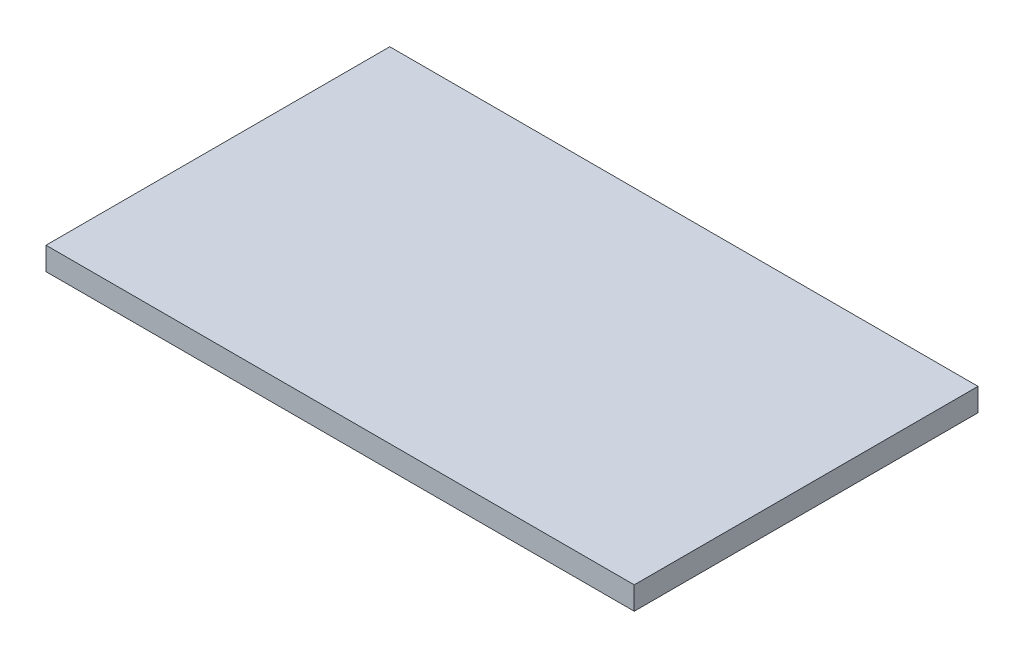
ISO-10303-21;
HEADER;
FILE_DESCRIPTION(('STEP AP214'),'2;1');
FILE_NAME('part.step','',(''),(''),'','','');
FILE_SCHEMA(('AUTOMOTIVE_DESIGN { 1 0 10303 214 1 1 1 1 }'));
ENDSEC;
DATA;
#1=APPLICATION_CONTEXT('core data for automotive mechanical design processes');
#2=APPLICATION_PROTOCOL_DEFINITION('international standard','automotive_design',2000,#1);
#3=PRODUCT_CONTEXT('',#1,'mechanical');
#4=PRODUCT('Part','Part','',(#3));
#5=PRODUCT_RELATED_PRODUCT_CATEGORY('part','',(#4));
#6=PRODUCT_DEFINITION_FORMATION('','',#4);
#7=PRODUCT_DEFINITION_CONTEXT('part definition',#1,'design');
#8=PRODUCT_DEFINITION('design','',#6,#7);
#9=PRODUCT_DEFINITION_SHAPE('','',#8);
#10=(LENGTH_UNIT() NAMED_UNIT(*) SI_UNIT(.MILLI.,.METRE.));
#11=(NAMED_UNIT(*) PLANE_ANGLE_UNIT() SI_UNIT($,.RADIAN.));
#12=(NAMED_UNIT(*) SI_UNIT($,.STERADIAN.) SOLID_ANGLE_UNIT());
#13=UNCERTAINTY_MEASURE_WITH_UNIT(LENGTH_MEASURE(1.E-05),#10,'distance_accuracy_value','');
#14=(GEOMETRIC_REPRESENTATION_CONTEXT(3) GLOBAL_UNCERTAINTY_ASSIGNED_CONTEXT((#13)) GLOBAL_UNIT_ASSIGNED_CONTEXT((#10,
#11,#12)) REPRESENTATION_CONTEXT('',''));
#15=CARTESIAN_POINT('',(0.,0.,0.));
#16=DIRECTION('',(0.,0.,1.));
#17=DIRECTION('',(1.,0.,0.));
#18=AXIS2_PLACEMENT_3D('',#15,#16,#17);
#19=CARTESIAN_POINT('',(-36.5928143712575,3.,-17.5703592814371));
#20=DIRECTION('',(1.,0.,0.));
#21=DIRECTION('',(0.,0.,-1.));
#22=AXIS2_PLACEMENT_3D('',#19,#20,#21);
#23=PLANE('',#22);
#24=DIRECTION('',(0.,0.,1.));
#25=VECTOR('',#24,1.);
#26=CARTESIAN_POINT('',(-36.5928143712575,0.,-17.5703592814371));
#27=LINE('',#26,#25);
#28=CARTESIAN_POINT('',(-36.5928143712575,0.,-17.5703592814371));
#29=VERTEX_POINT('',#28);
#30=CARTESIAN_POINT('',(-36.5928143712575,0.,27.4296407185629));
#31=VERTEX_POINT('',#30);
#32=EDGE_CURVE('E98',#29,#31,#27,.T.);
#33=ORIENTED_EDGE('',*,*,#32,.T.);
#34=DIRECTION('',(0.,-1.,0.));
#35=VECTOR('',#34,1.);
#36=CARTESIAN_POINT('',(-36.5928143712575,3.,27.4296407185629));
#37=LINE('',#36,#35);
#38=CARTESIAN_POINT('',(-36.5928143712575,3.,27.4296407185629));
#39=VERTEX_POINT('',#38);
#40=EDGE_CURVE('E11',#39,#31,#37,.T.);
#41=ORIENTED_EDGE('',*,*,#40,.F.);
#42=DIRECTION('',(0.,0.,1.));
#43=VECTOR('',#42,1.);
#44=CARTESIAN_POINT('',(-36.5928143712575,3.,-17.5703592814371));
#45=LINE('',#44,#43);
#46=CARTESIAN_POINT('',(-36.5928143712575,3.,-17.5703592814371));
#47=VERTEX_POINT('',#46);
#48=EDGE_CURVE('E86',#47,#39,#45,.T.);
#49=ORIENTED_EDGE('',*,*,#48,.F.);
#50=DIRECTION('',(0.,-1.,0.));
#51=VECTOR('',#50,1.);
#52=CARTESIAN_POINT('',(-36.5928143712575,3.,-17.5703592814371));
#53=LINE('',#52,#51);
#54=EDGE_CURVE('E94',#47,#29,#53,.T.);
#55=ORIENTED_EDGE('',*,*,#54,.T.);
#56=EDGE_LOOP('',(#33,#41,#49,#55));
#57=FACE_BOUND('',#56,.T.);
#58=ADVANCED_FACE('F35',(#57),#23,.F.);
#59=CARTESIAN_POINT('',(-36.5928143712575,3.,27.4296407185629));
#60=DIRECTION('',(0.,0.,-1.));
#61=DIRECTION('',(-1.,0.,0.));
#62=AXIS2_PLACEMENT_3D('',#59,#60,#61);
#63=PLANE('',#62);
#64=DIRECTION('',(1.,0.,0.));
#65=VECTOR('',#64,1.);
#66=CARTESIAN_POINT('',(-36.5928143712575,0.,27.4296407185629));
#67=LINE('',#66,#65);
#68=CARTESIAN_POINT('',(40.4071856287425,0.,27.4296407185629));
#69=VERTEX_POINT('',#68);
#70=EDGE_CURVE('E90',#31,#69,#67,.T.);
#71=ORIENTED_EDGE('',*,*,#70,.T.);
#72=DIRECTION('',(0.,-1.,0.));
#73=VECTOR('',#72,1.);
#74=CARTESIAN_POINT('',(40.4071856287425,3.,27.4296407185629));
#75=LINE('',#74,#73);
#76=CARTESIAN_POINT('',(40.4071856287425,3.,27.4296407185629));
#77=VERTEX_POINT('',#76);
#78=EDGE_CURVE('E43',#77,#69,#75,.T.);
#79=ORIENTED_EDGE('',*,*,#78,.F.);
#80=DIRECTION('',(1.,0.,0.));
#81=VECTOR('',#80,1.);
#82=CARTESIAN_POINT('',(-36.5928143712575,3.,27.4296407185629));
#83=LINE('',#82,#81);
#84=EDGE_CURVE('E81',#39,#77,#83,.T.);
#85=ORIENTED_EDGE('',*,*,#84,.F.);
#86=ORIENTED_EDGE('',*,*,#40,.T.);
#87=EDGE_LOOP('',(#71,#79,#85,#86));
#88=FACE_BOUND('',#87,.T.);
#89=ADVANCED_FACE('F89',(#88),#63,.F.);
#90=CARTESIAN_POINT('',(40.4071856287425,3.,-17.5703592814371));
#91=DIRECTION('',(-1.,0.,0.));
#92=DIRECTION('',(0.,0.,1.));
#93=AXIS2_PLACEMENT_3D('',#90,#91,#92);
#94=PLANE('',#93);
#95=DIRECTION('',(0.,0.,-1.));
#96=VECTOR('',#95,1.);
#97=CARTESIAN_POINT('',(40.4071856287425,0.,-17.5703592814371));
#98=LINE('',#97,#96);
#99=CARTESIAN_POINT('',(40.4071856287425,0.,-17.5703592814371));
#100=VERTEX_POINT('',#99);
#101=EDGE_CURVE('E68',#69,#100,#98,.T.);
#102=ORIENTED_EDGE('',*,*,#101,.T.);
#103=DIRECTION('',(0.,-1.,0.));
#104=VECTOR('',#103,1.);
#105=CARTESIAN_POINT('',(40.4071856287425,3.,-17.5703592814371));
#106=LINE('',#105,#104);
#107=CARTESIAN_POINT('',(40.4071856287425,3.,-17.5703592814371));
#108=VERTEX_POINT('',#107);
#109=EDGE_CURVE('E91',#108,#100,#106,.T.);
#110=ORIENTED_EDGE('',*,*,#109,.F.);
#111=DIRECTION('',(0.,0.,-1.));
#112=VECTOR('',#111,1.);
#113=CARTESIAN_POINT('',(40.4071856287425,3.,-17.5703592814371));
#114=LINE('',#113,#112);
#115=EDGE_CURVE('E84',#77,#108,#114,.T.);
#116=ORIENTED_EDGE('',*,*,#115,.F.);
#117=ORIENTED_EDGE('',*,*,#78,.T.);
#118=EDGE_LOOP('',(#102,#110,#116,#117));
#119=FACE_BOUND('',#118,.T.);
#120=ADVANCED_FACE('F92',(#119),#94,.F.);
#121=CARTESIAN_POINT('',(-36.5928143712575,3.,-17.5703592814371));
#122=DIRECTION('',(0.,0.,1.));
#123=DIRECTION('',(1.,0.,0.));
#124=AXIS2_PLACEMENT_3D('',#121,#122,#123);
#125=PLANE('',#124);
#126=DIRECTION('',(-1.,0.,0.));
#127=VECTOR('',#126,1.);
#128=CARTESIAN_POINT('',(-36.5928143712575,0.,-17.5703592814371));
#129=LINE('',#128,#127);
#130=EDGE_CURVE('E74',#100,#29,#129,.T.);
#131=ORIENTED_EDGE('',*,*,#130,.T.);
#132=ORIENTED_EDGE('',*,*,#54,.F.);
#133=DIRECTION('',(-1.,0.,0.));
#134=VECTOR('',#133,1.);
#135=CARTESIAN_POINT('',(-36.5928143712575,3.,-17.5703592814371));
#136=LINE('',#135,#134);
#137=EDGE_CURVE('E51',#108,#47,#136,.T.);
#138=ORIENTED_EDGE('',*,*,#137,.F.);
#139=ORIENTED_EDGE('',*,*,#109,.T.);
#140=EDGE_LOOP('',(#131,#132,#138,#139));
#141=FACE_BOUND('',#140,.T.);
#142=ADVANCED_FACE('F105',(#141),#125,.F.);
#143=CARTESIAN_POINT('',(0.,3.,0.));
#144=DIRECTION('',(0.,1.,0.));
#145=DIRECTION('',(0.,0.,1.));
#146=AXIS2_PLACEMENT_3D('',#143,#144,#145);
#147=PLANE('',#146);
#148=ORIENTED_EDGE('',*,*,#48,.T.);
#149=ORIENTED_EDGE('',*,*,#84,.T.);
#150=ORIENTED_EDGE('',*,*,#115,.T.);
#151=ORIENTED_EDGE('',*,*,#137,.T.);
#152=EDGE_LOOP('',(#148,#149,#150,#151));
#153=FACE_BOUND('',#152,.T.);
#154=ADVANCED_FACE('F82',(#153),#147,.T.);
#155=CARTESIAN_POINT('',(0.,0.,0.));
#156=DIRECTION('',(0.,1.,0.));
#157=DIRECTION('',(0.,0.,1.));
#158=AXIS2_PLACEMENT_3D('',#155,#156,#157);
#159=PLANE('',#158);
#160=ORIENTED_EDGE('',*,*,#32,.F.);
#161=ORIENTED_EDGE('',*,*,#130,.F.);
#162=ORIENTED_EDGE('',*,*,#101,.F.);
#163=ORIENTED_EDGE('',*,*,#70,.F.);
#164=EDGE_LOOP('',(#160,#161,#162,#163));
#165=FACE_BOUND('',#164,.T.);
#166=ADVANCED_FACE('F108',(#165),#159,.F.);
#167=CLOSED_SHELL('',(#58,#89,#120,#142,#154,#166));
#168=MANIFOLD_SOLID_BREP('B2',#167);
#169=ADVANCED_BREP_SHAPE_REPRESENTATION('',(#18,#168),#14);
#170=SHAPE_DEFINITION_REPRESENTATION(#9,#169);
ENDSEC;
END-ISO-10303-21;
